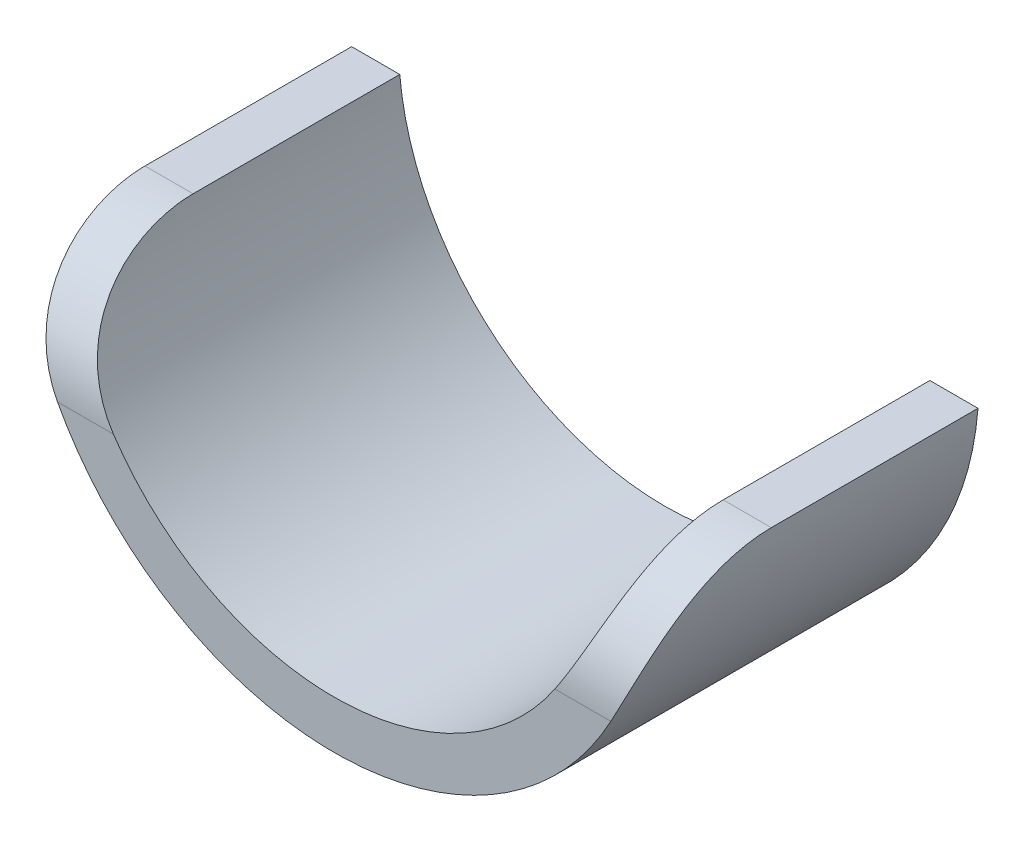
ISO-10303-21;
HEADER;
FILE_DESCRIPTION(('STEP AP214'),'2;1');
FILE_NAME('part.step','',(''),(''),'','','');
FILE_SCHEMA(('AUTOMOTIVE_DESIGN { 1 0 10303 214 1 1 1 1 }'));
ENDSEC;
DATA;
#1=APPLICATION_CONTEXT('core data for automotive mechanical design processes');
#2=APPLICATION_PROTOCOL_DEFINITION('international standard','automotive_design',2000,#1);
#3=PRODUCT_CONTEXT('',#1,'mechanical');
#4=PRODUCT('Part','Part','',(#3));
#5=PRODUCT_RELATED_PRODUCT_CATEGORY('part','',(#4));
#6=PRODUCT_DEFINITION_FORMATION('','',#4);
#7=PRODUCT_DEFINITION_CONTEXT('part definition',#1,'design');
#8=PRODUCT_DEFINITION('design','',#6,#7);
#9=PRODUCT_DEFINITION_SHAPE('','',#8);
#10=(LENGTH_UNIT() NAMED_UNIT(*) SI_UNIT(.MILLI.,.METRE.));
#11=(NAMED_UNIT(*) PLANE_ANGLE_UNIT() SI_UNIT($,.RADIAN.));
#12=(NAMED_UNIT(*) SI_UNIT($,.STERADIAN.) SOLID_ANGLE_UNIT());
#13=UNCERTAINTY_MEASURE_WITH_UNIT(LENGTH_MEASURE(1.E-05),#10,'distance_accuracy_value','');
#14=(GEOMETRIC_REPRESENTATION_CONTEXT(3) GLOBAL_UNCERTAINTY_ASSIGNED_CONTEXT((#13)) GLOBAL_UNIT_ASSIGNED_CONTEXT((#10,
#11,#12)) REPRESENTATION_CONTEXT('',''));
#15=CARTESIAN_POINT('',(0.,0.,0.));
#16=DIRECTION('',(0.,0.,1.));
#17=DIRECTION('',(1.,0.,0.));
#18=AXIS2_PLACEMENT_3D('',#15,#16,#17);
#19=CARTESIAN_POINT('',(0.,0.,0.));
#20=DIRECTION('',(0.,0.,1.));
#21=DIRECTION('',(1.,0.,0.));
#22=AXIS2_PLACEMENT_3D('',#19,#20,#21);
#23=CYLINDRICAL_SURFACE('',#22,20.447);
#24=CARTESIAN_POINT('',(20.3580643480661,-1.905,15.875));
#25=CARTESIAN_POINT('',(20.3580283743182,-1.90497110377044,16.1402102298547));
#26=CARTESIAN_POINT('',(20.3570267347558,-1.91607541741178,16.4054180979471));
#27=CARTESIAN_POINT('',(20.352832188804,-1.96034336128463,16.9339666940401));
#28=CARTESIAN_POINT('',(20.3496393032408,-1.99350678186011,17.1973074397624));
#29=CARTESIAN_POINT('',(20.3408028731761,-2.08168051639916,17.7202328918196));
#30=CARTESIAN_POINT('',(20.3351596248361,-2.13668819010333,17.9798180481544));
#31=CARTESIAN_POINT('',(20.3209194671558,-2.26813517562933,18.4934176434537));
#32=CARTESIAN_POINT('',(20.312322614697,-2.34457407471701,18.7474321895985));
#33=CARTESIAN_POINT('',(20.2915062917797,-2.51837915517059,19.2482709412747));
#34=CARTESIAN_POINT('',(20.2792839976529,-2.61576163208615,19.4950893769526));
#35=CARTESIAN_POINT('',(20.2504056126832,-2.83065885374987,19.9795302579563));
#36=CARTESIAN_POINT('',(20.2337496012912,-2.94817323772638,20.2171528679814));
#37=CARTESIAN_POINT('',(20.1950801117434,-3.20235227155138,20.6813968667695));
#38=CARTESIAN_POINT('',(20.1730679625452,-3.33901216747872,20.9080209677631));
#39=CARTESIAN_POINT('',(20.1226806227278,-3.63034088398203,21.3486359485486));
#40=CARTESIAN_POINT('',(20.0943055576867,-3.78500934911329,21.5626270775587));
#41=CARTESIAN_POINT('',(20.030560824482,-4.10893379759801,21.9737910836964));
#42=CARTESIAN_POINT('',(19.9952828225731,-4.27798374878302,22.1711404551238));
#43=CARTESIAN_POINT('',(19.9165452957226,-4.63073177356297,22.5505271872285));
#44=CARTESIAN_POINT('',(19.8730858362156,-4.81442972999755,22.7325646703523));
#45=CARTESIAN_POINT('',(19.7771267369428,-5.19456017598145,23.0799400708122));
#46=CARTESIAN_POINT('',(19.724633310632,-5.39098385541034,23.2452893429092));
#47=CARTESIAN_POINT('',(19.6098279166227,-5.7946943075757,23.5583716618498));
#48=CARTESIAN_POINT('',(19.5475162461149,-6.00198075137795,23.7061052416692));
#49=CARTESIAN_POINT('',(19.4144755131979,-6.41906899364777,23.9791033271186));
#50=CARTESIAN_POINT('',(19.3440467118341,-6.62861897179975,24.1048995061703));
#51=CARTESIAN_POINT('',(19.1930529525103,-7.05389488573657,24.3386995097784));
#52=CARTESIAN_POINT('',(19.112488048742,-7.26962078849771,24.4467034294521));
#53=CARTESIAN_POINT('',(18.9409635820805,-7.70549373801176,24.6448963006855));
#54=CARTESIAN_POINT('',(18.8499893436497,-7.92564665685007,24.7350595989152));
#55=CARTESIAN_POINT('',(18.6578079286869,-8.36804475355945,24.8975042974088));
#56=CARTESIAN_POINT('',(18.5566012015262,-8.59028983916224,24.9697864824619));
#57=CARTESIAN_POINT('',(18.3442481822495,-9.03487826701948,25.09684626075));
#58=CARTESIAN_POINT('',(18.2331065776499,-9.25722151419627,25.151632053993));
#59=CARTESIAN_POINT('',(18.0012194838146,-9.70043791104377,25.2443926711542));
#60=CARTESIAN_POINT('',(17.8804721898793,-9.92131077597433,25.2823643272213));
#61=CARTESIAN_POINT('',(17.6302342348166,-10.3594428106772,25.3422214514659));
#62=CARTESIAN_POINT('',(17.5007676745595,-10.5767100272521,25.3641494218749));
#63=CARTESIAN_POINT('',(17.2334730625404,-11.0068892110169,25.3930413515876));
#64=CARTESIAN_POINT('',(17.0956499678061,-11.219803661908,25.4000140946186));
#65=CARTESIAN_POINT('',(16.9539054202856,-11.4300000000005,25.4));
#66=B_SPLINE_CURVE_WITH_KNOTS('',3,(#24,#25,#26,#27,#28,#29,#30,#31,#32,#33,#34,#35,#36,#37,#38,
#39,#40,#41,#42,#43,#44,#45,#46,#47,#48,#49,#50,#51,#52,#53,#54,#55,#56,#57,#58,#59,#60,#61,#62,
#63,#64,#65),.UNSPECIFIED.,.F.,.F.,(4,2,2,2,2,2,2,2,2,2,2,2,2,2,2,2,2,2,2,2,4),(0.,
0.795393423654689,1.59077928777244,2.38606904486716,3.18134348689319,3.97723896055609,
4.77312017295292,5.5688041133931,6.3644723516572,7.15021538340831,7.93595213111671,
8.72115060258975,9.50632531127379,10.2684854549721,11.0306415240326,11.7938856708571,
12.5570963134924,13.3199487366032,14.0829448230853,14.8439122217058,15.6044325550745),.UNSPECIFIED.);
#67=CARTESIAN_POINT('',(20.3580643480667,-1.905,15.875));
#68=VERTEX_POINT('',#67);
#69=CARTESIAN_POINT('',(16.9539054202858,-11.4300000000002,25.4));
#70=VERTEX_POINT('',#69);
#71=EDGE_CURVE('E120',#68,#70,#66,.T.);
#72=ORIENTED_EDGE('',*,*,#71,.F.);
#73=DIRECTION('',(0.,0.,-1.));
#74=VECTOR('',#73,1.);
#75=CARTESIAN_POINT('',(20.3580643480672,-1.905,25.4));
#76=LINE('',#75,#74);
#77=CARTESIAN_POINT('',(20.3580643480667,-1.905,0.));
#78=VERTEX_POINT('',#77);
#79=EDGE_CURVE('E67',#68,#78,#76,.T.);
#80=ORIENTED_EDGE('',*,*,#79,.T.);
#81=CARTESIAN_POINT('',(0.,0.,0.));
#82=DIRECTION('',(0.,0.,1.));
#83=DIRECTION('',(1.,0.,0.));
#84=AXIS2_PLACEMENT_3D('',#81,#82,#83);
#85=CIRCLE('',#84,20.447);
#86=CARTESIAN_POINT('',(-20.3580643480667,-1.905,0.));
#87=VERTEX_POINT('',#86);
#88=EDGE_CURVE('E21',#78,#87,#85,.F.);
#89=ORIENTED_EDGE('',*,*,#88,.T.);
#90=DIRECTION('',(0.,0.,-1.));
#91=VECTOR('',#90,1.);
#92=CARTESIAN_POINT('',(-20.3580643480672,-1.905,25.4));
#93=LINE('',#92,#91);
#94=CARTESIAN_POINT('',(-20.3580643480667,-1.905,15.875));
#95=VERTEX_POINT('',#94);
#96=EDGE_CURVE('E72',#87,#95,#93,.F.);
#97=ORIENTED_EDGE('',*,*,#96,.T.);
#98=CARTESIAN_POINT('',(-16.9539054202856,-11.4300000000005,25.4));
#99=CARTESIAN_POINT('',(-17.1110348965794,-11.1970109347337,25.4000226556267));
#100=CARTESIAN_POINT('',(-17.2633409521732,-10.9606584924527,25.3914500347272));
#101=CARTESIAN_POINT('',(-17.5576316342127,-10.482734509668,25.355805674674));
#102=CARTESIAN_POINT('',(-17.6996080681934,-10.2411590195225,25.3287194254924));
#103=CARTESIAN_POINT('',(-17.9727321356882,-9.7539249200564,25.2546221946283));
#104=CARTESIAN_POINT('',(-18.1038453856934,-9.50825609668638,25.2075506354637));
#105=CARTESIAN_POINT('',(-18.3540664977229,-9.01577956315713,25.0924335496911));
#106=CARTESIAN_POINT('',(-18.4731775128224,-8.76897217002004,25.0243935508085));
#107=CARTESIAN_POINT('',(-18.6995490297243,-8.27531248509799,24.8661675409617));
#108=CARTESIAN_POINT('',(-18.8067447749872,-8.02846661678055,24.775868352864));
#109=CARTESIAN_POINT('',(-19.0083559040057,-7.53872313086937,24.572921907335));
#110=CARTESIAN_POINT('',(-19.1027701242965,-7.29582587447465,24.4602726177374));
#111=CARTESIAN_POINT('',(-19.2786895398163,-6.81738744881162,24.2129724372477));
#112=CARTESIAN_POINT('',(-19.360222754746,-6.58183123312732,24.0783706334243));
#113=CARTESIAN_POINT('',(-19.5110161349572,-6.12037421258561,23.7875131399525));
#114=CARTESIAN_POINT('',(-19.5802775147309,-5.89447245394794,23.6312595958167));
#115=CARTESIAN_POINT('',(-19.7015990829016,-5.47451213954666,23.3128068999594));
#116=CARTESIAN_POINT('',(-19.7546393047696,-5.27940511020501,23.1523591154929));
#117=CARTESIAN_POINT('',(-19.8518094278577,-4.90138340496403,22.8152389982501));
#118=CARTESIAN_POINT('',(-19.8959398183608,-4.71846805992874,22.6385675571706));
#119=CARTESIAN_POINT('',(-19.9761515798859,-4.36644050139858,22.2700553152654));
#120=CARTESIAN_POINT('',(-20.0122275652698,-4.19733757130713,22.0782044800326));
#121=CARTESIAN_POINT('',(-20.0772114901172,-3.87459604014159,21.6807751805306));
#122=CARTESIAN_POINT('',(-20.1061193740591,-3.72095755885489,21.4751966099471));
#123=CARTESIAN_POINT('',(-20.1574291495039,-3.43207667548712,21.0541231471337));
#124=CARTESIAN_POINT('',(-20.1798996243165,-3.2966491893578,20.8387634789851));
#125=CARTESIAN_POINT('',(-20.2196697315628,-3.0432271402361,20.39743775902));
#126=CARTESIAN_POINT('',(-20.2369670251252,-2.92524047465024,20.171466963014));
#127=CARTESIAN_POINT('',(-20.2672218373143,-2.70769131917894,19.7106066360459));
#128=CARTESIAN_POINT('',(-20.2801802255078,-2.60812513940783,19.4757189026592));
#129=CARTESIAN_POINT('',(-20.3025150068543,-2.42815162760397,18.9986688117078));
#130=CARTESIAN_POINT('',(-20.3118930616464,-2.34773541457413,18.756509885141));
#131=CARTESIAN_POINT('',(-20.3267077281063,-2.21553591633542,18.2975700959992));
#132=CARTESIAN_POINT('',(-20.3324935680789,-2.16141368417326,18.0814702333096));
#133=CARTESIAN_POINT('',(-20.3421616557291,-2.06843955546326,17.6459826812805));
#134=CARTESIAN_POINT('',(-20.3460440736285,-2.02958629348421,17.4265952877516));
#135=CARTESIAN_POINT('',(-20.352157279265,-1.96736786921803,16.9857348518923));
#136=CARTESIAN_POINT('',(-20.3543889527872,-1.94399440122066,16.7642629927905));
#137=CARTESIAN_POINT('',(-20.3573335916408,-1.91280264393239,16.3201947515685));
#138=CARTESIAN_POINT('',(-20.358046407436,-1.9049858862538,16.097598260887));
#139=CARTESIAN_POINT('',(-20.3580643480661,-1.905,15.875));
#140=B_SPLINE_CURVE_WITH_KNOTS('',3,(#98,#99,#100,#101,#102,#103,#104,#105,#106,#107,#108,#109,
#110,#111,#112,#113,#114,#115,#116,#117,#118,#119,#120,#121,#122,#123,#124,#125,#126,#127,#128,
#129,#130,#131,#132,#133,#134,#135,#136,#137,#138,#139),.UNSPECIFIED.,.F.,.F.,(4,2,2,2,2,2,2,2,
2,2,2,2,2,2,2,2,2,2,2,2,4),(0.,0.843012231859937,1.68668593203059,2.53293535688573,
3.37896188300101,4.22938213047327,5.07987973723872,5.92850102018473,6.77703827167084,
7.55044553476643,8.32381031468319,9.09769067222064,9.87157702376176,10.6368826673751,
11.4025337956785,12.1680313867014,12.9331732758273,13.6011795842376,14.2691261424277,
14.9367140217585,15.6043676241909),.UNSPECIFIED.);
#141=CARTESIAN_POINT('',(-16.9539054202858,-11.4300000000002,25.4));
#142=VERTEX_POINT('',#141);
#143=EDGE_CURVE('E112',#142,#95,#140,.T.);
#144=ORIENTED_EDGE('',*,*,#143,.F.);
#145=CARTESIAN_POINT('',(0.,0.,25.4));
#146=DIRECTION('',(0.,0.,1.));
#147=DIRECTION('',(1.,0.,0.));
#148=AXIS2_PLACEMENT_3D('',#145,#146,#147);
#149=CIRCLE('',#148,20.447);
#150=EDGE_CURVE('E118',#70,#142,#149,.F.);
#151=ORIENTED_EDGE('',*,*,#150,.F.);
#152=EDGE_LOOP('',(#72,#80,#89,#97,#144,#151));
#153=FACE_BOUND('',#152,.T.);
#154=ADVANCED_FACE('F17',(#153),#23,.F.);
#155=CARTESIAN_POINT('',(-24.13,-1.905,25.4));
#156=DIRECTION('',(0.,-1.,0.));
#157=DIRECTION('',(0.,0.,-1.));
#158=AXIS2_PLACEMENT_3D('',#155,#156,#157);
#159=PLANE('',#158);
#160=DIRECTION('',(1.,0.,0.));
#161=VECTOR('',#160,1.);
#162=CARTESIAN_POINT('',(0.,-1.905,0.));
#163=LINE('',#162,#161);
#164=CARTESIAN_POINT('',(-24.0546850945923,-1.90499999999999,0.));
#165=VERTEX_POINT('',#164);
#166=EDGE_CURVE('E76',#87,#165,#163,.F.);
#167=ORIENTED_EDGE('',*,*,#166,.T.);
#168=DIRECTION('',(0.,0.,1.));
#169=VECTOR('',#168,1.);
#170=CARTESIAN_POINT('',(-24.0546850945923,-1.90499999999997,0.));
#171=LINE('',#170,#169);
#172=CARTESIAN_POINT('',(-24.0546850945923,-1.90499999999999,15.875));
#173=VERTEX_POINT('',#172);
#174=EDGE_CURVE('E145',#173,#165,#171,.F.);
#175=ORIENTED_EDGE('',*,*,#174,.F.);
#176=DIRECTION('',(-1.,0.,0.));
#177=VECTOR('',#176,1.);
#178=CARTESIAN_POINT('',(86.7700600732234,-1.905,15.875));
#179=LINE('',#178,#177);
#180=EDGE_CURVE('E79',#95,#173,#179,.T.);
#181=ORIENTED_EDGE('',*,*,#180,.F.);
#182=ORIENTED_EDGE('',*,*,#96,.F.);
#183=EDGE_LOOP('',(#167,#175,#181,#182));
#184=FACE_BOUND('',#183,.T.);
#185=ADVANCED_FACE('F73',(#184),#159,.F.);
#186=CARTESIAN_POINT('',(0.,0.,0.));
#187=DIRECTION('',(0.,0.,1.));
#188=DIRECTION('',(1.,0.,0.));
#189=AXIS2_PLACEMENT_3D('',#186,#187,#188);
#190=PLANE('',#189);
#191=DIRECTION('',(1.,0.,0.));
#192=VECTOR('',#191,1.);
#193=CARTESIAN_POINT('',(-24.13,-1.905,0.));
#194=LINE('',#193,#192);
#195=CARTESIAN_POINT('',(24.0546850945923,-1.905,0.));
#196=VERTEX_POINT('',#195);
#197=EDGE_CURVE('E91',#78,#196,#194,.T.);
#198=ORIENTED_EDGE('',*,*,#197,.T.);
#199=CARTESIAN_POINT('',(0.,0.,0.));
#200=DIRECTION('',(0.,0.,1.));
#201=DIRECTION('',(1.,0.,0.));
#202=AXIS2_PLACEMENT_3D('',#199,#200,#201);
#203=CIRCLE('',#202,24.13);
#204=EDGE_CURVE('E87',#165,#196,#203,.T.);
#205=ORIENTED_EDGE('',*,*,#204,.F.);
#206=ORIENTED_EDGE('',*,*,#166,.F.);
#207=ORIENTED_EDGE('',*,*,#88,.F.);
#208=EDGE_LOOP('',(#198,#205,#206,#207));
#209=FACE_BOUND('',#208,.T.);
#210=ADVANCED_FACE('F85',(#209),#190,.F.);
#211=CARTESIAN_POINT('',(-24.13,-1.905,25.4));
#212=DIRECTION('',(0.,-1.,0.));
#213=DIRECTION('',(0.,0.,-1.));
#214=AXIS2_PLACEMENT_3D('',#211,#212,#213);
#215=PLANE('',#214);
#216=ORIENTED_EDGE('',*,*,#197,.F.);
#217=ORIENTED_EDGE('',*,*,#79,.F.);
#218=DIRECTION('',(-1.,0.,0.));
#219=VECTOR('',#218,1.);
#220=CARTESIAN_POINT('',(86.7700600732234,-1.905,15.875));
#221=LINE('',#220,#219);
#222=CARTESIAN_POINT('',(24.0546850945923,-1.905,15.875));
#223=VERTEX_POINT('',#222);
#224=EDGE_CURVE('E124',#223,#68,#221,.T.);
#225=ORIENTED_EDGE('',*,*,#224,.F.);
#226=DIRECTION('',(0.,0.,1.));
#227=VECTOR('',#226,1.);
#228=CARTESIAN_POINT('',(24.0546850945923,-1.90499999999999,0.));
#229=LINE('',#228,#227);
#230=EDGE_CURVE('E138',#196,#223,#229,.T.);
#231=ORIENTED_EDGE('',*,*,#230,.F.);
#232=EDGE_LOOP('',(#216,#217,#225,#231));
#233=FACE_BOUND('',#232,.T.);
#234=ADVANCED_FACE('F129',(#233),#215,.F.);
#235=CARTESIAN_POINT('',(86.7700600732234,-11.43,15.875));
#236=DIRECTION('',(-1.,0.,0.));
#237=DIRECTION('',(0.,0.,1.));
#238=AXIS2_PLACEMENT_3D('',#235,#236,#237);
#239=CYLINDRICAL_SURFACE('',#238,9.525);
#240=ORIENTED_EDGE('',*,*,#224,.T.);
#241=ORIENTED_EDGE('',*,*,#71,.T.);
#242=DIRECTION('',(1.,0.,0.));
#243=VECTOR('',#242,1.);
#244=CARTESIAN_POINT('',(0.,-11.43,25.4));
#245=LINE('',#244,#243);
#246=CARTESIAN_POINT('',(21.2511646739655,-11.43,25.4));
#247=VERTEX_POINT('',#246);
#248=EDGE_CURVE('E119',#247,#70,#245,.F.);
#249=ORIENTED_EDGE('',*,*,#248,.F.);
#250=CARTESIAN_POINT('',(24.0546850945923,-1.905,15.875));
#251=CARTESIAN_POINT('',(24.0546543706783,-1.90497112249099,16.1409714413934));
#252=CARTESIAN_POINT('',(24.0538018907344,-1.91613908815105,16.4069400320739));
#253=CARTESIAN_POINT('',(24.0502314004206,-1.96066129940309,16.9369961272644));
#254=CARTESIAN_POINT('',(24.0475134277582,-1.99401509654734,17.2010836696873));
#255=CARTESIAN_POINT('',(24.0399910936523,-2.08268810274374,17.7254334921366));
#256=CARTESIAN_POINT('',(24.0351873665735,-2.1380006327919,17.9856969103763));
#257=CARTESIAN_POINT('',(24.0230644040504,-2.2701777631287,18.5006286159835));
#258=CARTESIAN_POINT('',(24.0157452121526,-2.34704199031998,18.7552970001285));
#259=CARTESIAN_POINT('',(23.9980216823762,-2.52181707329971,19.2573979344783));
#260=CARTESIAN_POINT('',(23.9876151932781,-2.61974259140439,19.5048253066537));
#261=CARTESIAN_POINT('',(23.9630257307452,-2.83586324053375,19.9904676925044));
#262=CARTESIAN_POINT('',(23.9488428057835,-2.9540581113811,20.22868282438));
#263=CARTESIAN_POINT('',(23.9159133288637,-3.20976539159896,20.6941133896688));
#264=CARTESIAN_POINT('',(23.8971677906916,-3.34727350681212,20.9213312531841));
#265=CARTESIAN_POINT('',(23.8542560267361,-3.64051036300694,21.3631480940328));
#266=CARTESIAN_POINT('',(23.8300898850306,-3.79623882135804,21.5777472670274));
#267=CARTESIAN_POINT('',(23.7757019327644,-4.12311644738061,21.9908668963949));
#268=CARTESIAN_POINT('',(23.7455368268045,-4.29411352349554,22.1895151415346));
#269=CARTESIAN_POINT('',(23.6781748356056,-4.65123007876343,22.5714355282988));
#270=CARTESIAN_POINT('',(23.6409779826139,-4.83734948856389,22.7547077404316));
#271=CARTESIAN_POINT('',(23.5587888909164,-5.22294907941938,23.1045141824383));
#272=CARTESIAN_POINT('',(23.5138002140805,-5.42242313023071,23.2710560055365));
#273=CARTESIAN_POINT('',(23.4153383321293,-5.83295582002549,23.5864014341545));
#274=CARTESIAN_POINT('',(23.3618653413296,-6.04401416629933,23.7352054875674));
#275=CARTESIAN_POINT('',(23.2471317644862,-6.47113711214399,24.011251447842));
#276=CARTESIAN_POINT('',(23.1860605993367,-6.68700031712436,24.1388840349217));
#277=CARTESIAN_POINT('',(23.0549352631465,-7.12596104699,24.375769016095));
#278=CARTESIAN_POINT('',(22.9848810136632,-7.34905863503499,24.4850212496675));
#279=CARTESIAN_POINT('',(22.8355565811858,-7.80069709441672,24.6849280427475));
#280=CARTESIAN_POINT('',(22.7562780033086,-8.02924277118396,24.7755654505681));
#281=CARTESIAN_POINT('',(22.5885730040502,-8.48959759740636,24.9380698866867));
#282=CARTESIAN_POINT('',(22.5001473529379,-8.72140647065202,25.0099384936993));
#283=CARTESIAN_POINT('',(22.3243212812767,-9.16141574281792,25.1283965862276));
#284=CARTESIAN_POINT('',(22.2378315842086,-9.36947657204712,25.176872535527));
#285=CARTESIAN_POINT('',(22.0579381550128,-9.7854805725288,25.2593565501162));
#286=CARTESIAN_POINT('',(21.9645342350342,-9.9934237404298,25.2933642221513));
#287=CARTESIAN_POINT('',(21.7713545092491,-10.4075477143403,25.347259877931));
#288=CARTESIAN_POINT('',(21.6715943779709,-10.6137315346704,25.3671812336891));
#289=CARTESIAN_POINT('',(21.4659113001519,-11.023810001918,25.393555082785));
#290=CARTESIAN_POINT('',(21.3599900405858,-11.2277052573947,25.4000112453408));
#291=CARTESIAN_POINT('',(21.2511646739657,-11.4299999999997,25.4));
#292=B_SPLINE_CURVE_WITH_KNOTS('',3,(#250,#251,#252,#253,#254,#255,#256,#257,#258,#259,#260,
#261,#262,#263,#264,#265,#266,#267,#268,#269,#270,#271,#272,#273,#274,#275,#276,#277,#278,#279,
#280,#281,#282,#283,#284,#285,#286,#287,#288,#289,#290,#291),.UNSPECIFIED.,.F.,.F.,(4,2,2,2,2,2,
2,2,2,2,2,2,2,2,2,2,2,2,2,2,4),(0.,0.79767480720018,1.59533349129077,2.39274974387176,
3.19015219264293,3.98811157936094,4.78606072424157,5.58383273105667,6.38159236462162,
7.17214191497642,7.96268783999794,8.75287333268876,9.54303886831845,10.316430031771,
11.0898279491281,11.8639353089751,12.6379775347455,13.3288503903547,14.0197420230187,
14.7089913240002,15.3980527824101),.UNSPECIFIED.);
#293=EDGE_CURVE('E133',#223,#247,#292,.T.);
#294=ORIENTED_EDGE('',*,*,#293,.F.);
#295=EDGE_LOOP('',(#240,#241,#249,#294));
#296=FACE_BOUND('',#295,.T.);
#297=ADVANCED_FACE('F125',(#296),#239,.T.);
#298=CARTESIAN_POINT('',(0.,0.,25.4));
#299=DIRECTION('',(0.,0.,1.));
#300=DIRECTION('',(1.,0.,0.));
#301=AXIS2_PLACEMENT_3D('',#298,#299,#300);
#302=PLANE('',#301);
#303=ORIENTED_EDGE('',*,*,#150,.T.);
#304=DIRECTION('',(-1.,0.,0.));
#305=VECTOR('',#304,1.);
#306=CARTESIAN_POINT('',(86.7700600732234,-11.43,25.4));
#307=LINE('',#306,#305);
#308=CARTESIAN_POINT('',(-21.2511646739656,-11.4299999999999,25.4));
#309=VERTEX_POINT('',#308);
#310=EDGE_CURVE('E36',#309,#142,#307,.F.);
#311=ORIENTED_EDGE('',*,*,#310,.F.);
#312=CARTESIAN_POINT('',(0.,0.,25.4));
#313=DIRECTION('',(0.,0.,1.));
#314=DIRECTION('',(1.,0.,0.));
#315=AXIS2_PLACEMENT_3D('',#312,#313,#314);
#316=CIRCLE('',#315,24.13);
#317=EDGE_CURVE('E27',#247,#309,#316,.F.);
#318=ORIENTED_EDGE('',*,*,#317,.F.);
#319=ORIENTED_EDGE('',*,*,#248,.T.);
#320=EDGE_LOOP('',(#303,#311,#318,#319));
#321=FACE_BOUND('',#320,.T.);
#322=ADVANCED_FACE('F107',(#321),#302,.T.);
#323=CARTESIAN_POINT('',(86.7700600732234,-11.43,15.875));
#324=DIRECTION('',(-1.,0.,0.));
#325=DIRECTION('',(0.,0.,1.));
#326=AXIS2_PLACEMENT_3D('',#323,#324,#325);
#327=CYLINDRICAL_SURFACE('',#326,9.525);
#328=ORIENTED_EDGE('',*,*,#180,.T.);
#329=CARTESIAN_POINT('',(-21.2511646739657,-11.4299999999997,25.4));
#330=CARTESIAN_POINT('',(-21.382433539311,-11.186022464054,25.4000262243007));
#331=CARTESIAN_POINT('',(-21.5094658719946,-10.9396845502,25.390625226913));
#332=CARTESIAN_POINT('',(-21.7544876609396,-10.4439055163115,25.3520763604122));
#333=CARTESIAN_POINT('',(-21.8724717766097,-10.1944626630501,25.3229169274913));
#334=CARTESIAN_POINT('',(-22.0988883031837,-9.6939031188028,25.2438811628811));
#335=CARTESIAN_POINT('',(-22.2073020174488,-9.44278413916148,25.1939653220145));
#336=CARTESIAN_POINT('',(-22.4138311063667,-8.94150477192927,25.0727976311978));
#337=CARTESIAN_POINT('',(-22.5119485785535,-8.69134419913728,25.0015501383378));
#338=CARTESIAN_POINT('',(-22.697987397351,-8.19324315777392,24.837035897122));
#339=CARTESIAN_POINT('',(-22.7858670176028,-7.94531533145681,24.74368343928));
#340=CARTESIAN_POINT('',(-22.950920286426,-7.45513554205424,24.5350822568299));
#341=CARTESIAN_POINT('',(-23.0280931434997,-7.21288399968715,24.4198319149111));
#342=CARTESIAN_POINT('',(-23.1717872843802,-6.73697795539704,24.1679808945322));
#343=CARTESIAN_POINT('',(-23.238325368346,-6.50331035205257,24.0314145781476));
#344=CARTESIAN_POINT('',(-23.3613112980713,-6.04664831564493,23.7374976111355));
#345=CARTESIAN_POINT('',(-23.417759861925,-5.82365312382973,23.5801484410583));
#346=CARTESIAN_POINT('',(-23.5178520749754,-5.40470991060279,23.2565289044685));
#347=CARTESIAN_POINT('',(-23.5620882559331,-5.20794553211151,23.09149629587));
#348=CARTESIAN_POINT('',(-23.6429526368408,-4.82757709066192,22.7452094936832));
#349=CARTESIAN_POINT('',(-23.6795811205675,-4.64397253699301,22.5639559055187));
#350=CARTESIAN_POINT('',(-23.7460034791518,-4.29143598197436,22.1863614795688));
#351=CARTESIAN_POINT('',(-23.7757936768714,-4.12251190492299,21.9900126000184));
#352=CARTESIAN_POINT('',(-23.8293278664702,-3.8008713904997,21.5836916173809));
#353=CARTESIAN_POINT('',(-23.8530718455232,-3.64815498751063,21.373719485395));
#354=CARTESIAN_POINT('',(-23.895213047223,-3.36104542848584,20.9429571443455));
#355=CARTESIAN_POINT('',(-23.9136419215247,-3.22654644377802,20.7222405269028));
#356=CARTESIAN_POINT('',(-23.9461355713094,-2.97581587645172,20.2703568855941));
#357=CARTESIAN_POINT('',(-23.9602003046431,-2.85958447026906,20.0391897608205));
#358=CARTESIAN_POINT('',(-23.9846954693647,-2.64628232956122,19.5680719041688));
#359=CARTESIAN_POINT('',(-23.9951268417838,-2.54920663658389,19.3281234644464));
#360=CARTESIAN_POINT('',(-24.0130070257699,-2.37488541721309,18.8410436270895));
#361=CARTESIAN_POINT('',(-24.0204562216298,-2.29763733622996,18.5939131593595));
#362=CARTESIAN_POINT('',(-24.0316919659944,-2.17660389124132,18.1429614045295));
#363=CARTESIAN_POINT('',(-24.0359096588211,-2.12922984902609,17.9401048839392));
#364=CARTESIAN_POINT('',(-24.0429774229925,-2.04787644322709,17.5317203009418));
#365=CARTESIAN_POINT('',(-24.0458276798666,-2.01389526265418,17.32619260484));
#366=CARTESIAN_POINT('',(-24.0503232209338,-1.95949981658251,16.913517140901));
#367=CARTESIAN_POINT('',(-24.0519695285443,-1.93907402968681,16.70637090067));
#368=CARTESIAN_POINT('',(-24.0541447550348,-1.9118178800914,16.2911504940653));
#369=CARTESIAN_POINT('',(-24.0546735144979,-1.90498945704754,16.0830761995474));
#370=CARTESIAN_POINT('',(-24.0546850945923,-1.905,15.875));
#371=B_SPLINE_CURVE_WITH_KNOTS('',3,(#329,#330,#331,#332,#333,#334,#335,#336,#337,#338,#339,
#340,#341,#342,#343,#344,#345,#346,#347,#348,#349,#350,#351,#352,#353,#354,#355,#356,#357,#358,
#359,#360,#361,#362,#363,#364,#365,#366,#367,#368,#369,#370),.UNSPECIFIED.,.F.,.F.,(4,2,2,2,2,2,
2,2,2,2,2,2,2,2,2,2,2,2,2,2,4),(0.,0.831053790770298,1.66259438406462,2.49572508742814,
3.32868573588823,4.16493056434454,5.00123717930455,5.83620930417517,6.67112197849122,
7.45196225401332,8.23277339798141,9.0140034275285,9.79523511433863,10.5717136526311,
11.3481996900132,12.1244844697336,12.9006691826561,13.5253091224102,14.1498642890196,
14.7738879332269,15.3980005876604),.UNSPECIFIED.);
#372=EDGE_CURVE('E11',#309,#173,#371,.T.);
#373=ORIENTED_EDGE('',*,*,#372,.F.);
#374=ORIENTED_EDGE('',*,*,#310,.T.);
#375=ORIENTED_EDGE('',*,*,#143,.T.);
#376=EDGE_LOOP('',(#328,#373,#374,#375));
#377=FACE_BOUND('',#376,.T.);
#378=ADVANCED_FACE('F103',(#377),#327,.T.);
#379=CARTESIAN_POINT('',(0.,0.,0.));
#380=DIRECTION('',(0.,0.,1.));
#381=DIRECTION('',(1.,0.,0.));
#382=AXIS2_PLACEMENT_3D('',#379,#380,#381);
#383=CYLINDRICAL_SURFACE('',#382,24.13);
#384=ORIENTED_EDGE('',*,*,#317,.T.);
#385=ORIENTED_EDGE('',*,*,#372,.T.);
#386=ORIENTED_EDGE('',*,*,#174,.T.);
#387=ORIENTED_EDGE('',*,*,#204,.T.);
#388=ORIENTED_EDGE('',*,*,#230,.T.);
#389=ORIENTED_EDGE('',*,*,#293,.T.);
#390=EDGE_LOOP('',(#384,#385,#386,#387,#388,#389));
#391=FACE_BOUND('',#390,.T.);
#392=ADVANCED_FACE('F101',(#391),#383,.T.);
#393=CLOSED_SHELL('',(#154,#185,#210,#234,#297,#322,#378,#392));
#394=MANIFOLD_SOLID_BREP('B1',#393);
#395=ADVANCED_BREP_SHAPE_REPRESENTATION('',(#18,#394),#14);
#396=SHAPE_DEFINITION_REPRESENTATION(#9,#395);
ENDSEC;
END-ISO-10303-21;
